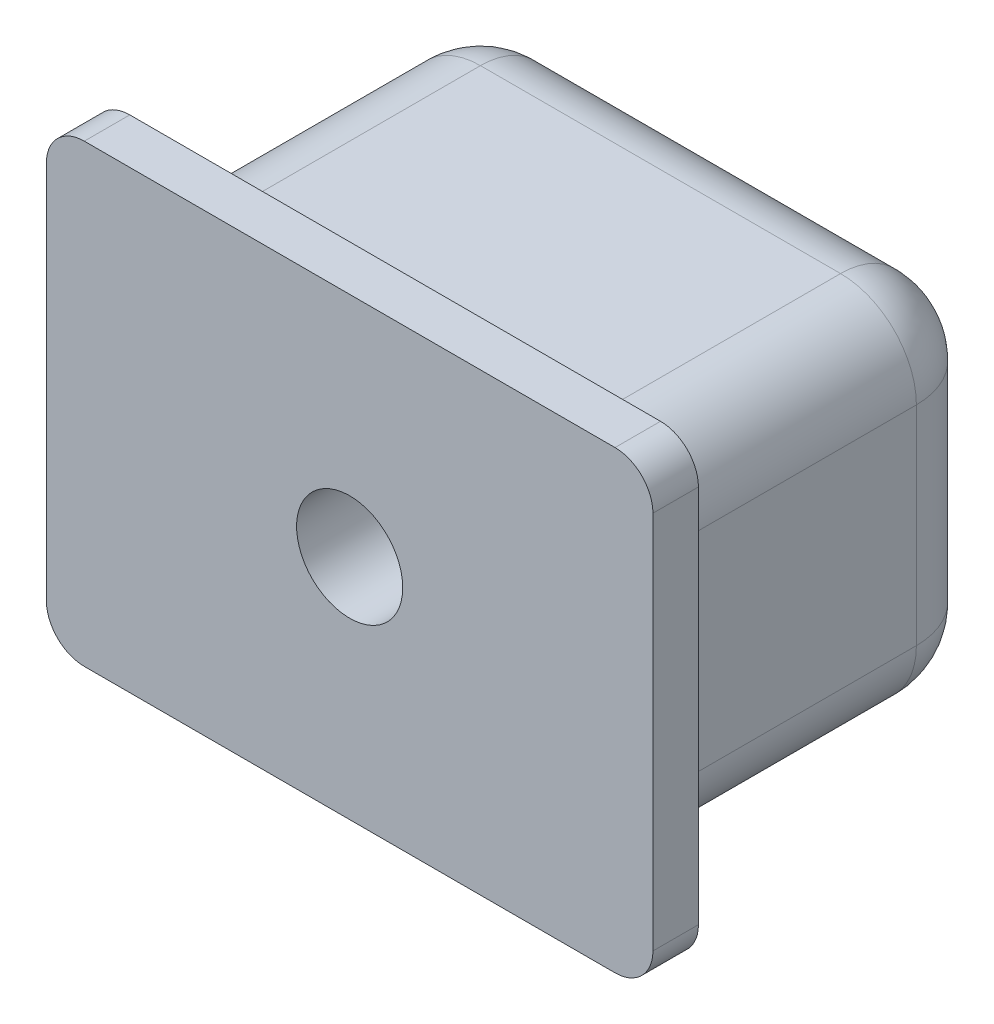
ISO-10303-21;
HEADER;
FILE_DESCRIPTION(('STEP AP214'),'2;1');
FILE_NAME('part.step','',(''),(''),'','','');
FILE_SCHEMA(('AUTOMOTIVE_DESIGN { 1 0 10303 214 1 1 1 1 }'));
ENDSEC;
DATA;
#1=APPLICATION_CONTEXT('core data for automotive mechanical design processes');
#2=APPLICATION_PROTOCOL_DEFINITION('international standard','automotive_design',2000,#1);
#3=PRODUCT_CONTEXT('',#1,'mechanical');
#4=PRODUCT('Part','Part','',(#3));
#5=PRODUCT_RELATED_PRODUCT_CATEGORY('part','',(#4));
#6=PRODUCT_DEFINITION_FORMATION('','',#4);
#7=PRODUCT_DEFINITION_CONTEXT('part definition',#1,'design');
#8=PRODUCT_DEFINITION('design','',#6,#7);
#9=PRODUCT_DEFINITION_SHAPE('','',#8);
#10=(LENGTH_UNIT() NAMED_UNIT(*) SI_UNIT(.MILLI.,.METRE.));
#11=(NAMED_UNIT(*) PLANE_ANGLE_UNIT() SI_UNIT($,.RADIAN.));
#12=(NAMED_UNIT(*) SI_UNIT($,.STERADIAN.) SOLID_ANGLE_UNIT());
#13=UNCERTAINTY_MEASURE_WITH_UNIT(LENGTH_MEASURE(1.E-05),#10,'distance_accuracy_value','');
#14=(GEOMETRIC_REPRESENTATION_CONTEXT(3) GLOBAL_UNCERTAINTY_ASSIGNED_CONTEXT((#13)) GLOBAL_UNIT_ASSIGNED_CONTEXT((#10,
#11,#12)) REPRESENTATION_CONTEXT('',''));
#15=CARTESIAN_POINT('',(0.,0.,0.));
#16=DIRECTION('',(0.,0.,1.));
#17=DIRECTION('',(1.,0.,0.));
#18=AXIS2_PLACEMENT_3D('',#15,#16,#17);
#19=CARTESIAN_POINT('',(6.75,-4.75,9.));
#20=DIRECTION('',(-1.,0.,0.));
#21=DIRECTION('',(0.,0.,1.));
#22=AXIS2_PLACEMENT_3D('',#19,#20,#21);
#23=PLANE('',#22);
#24=DIRECTION('',(0.,0.,-1.));
#25=VECTOR('',#24,1.);
#26=CARTESIAN_POINT('',(6.75,2.75,9.));
#27=LINE('',#26,#25);
#28=CARTESIAN_POINT('',(6.75,2.75,2.));
#29=VERTEX_POINT('',#28);
#30=CARTESIAN_POINT('',(6.75,2.75,8.6));
#31=VERTEX_POINT('',#30);
#32=EDGE_CURVE('E194',#29,#31,#27,.F.);
#33=ORIENTED_EDGE('',*,*,#32,.T.);
#34=DIRECTION('',(0.,1.,0.));
#35=VECTOR('',#34,1.);
#36=CARTESIAN_POINT('',(6.75,-4.75,8.6));
#37=LINE('',#36,#35);
#38=CARTESIAN_POINT('',(6.75,-2.75,8.6));
#39=VERTEX_POINT('',#38);
#40=EDGE_CURVE('E294',#31,#39,#37,.F.);
#41=ORIENTED_EDGE('',*,*,#40,.T.);
#42=DIRECTION('',(0.,0.,-1.));
#43=VECTOR('',#42,1.);
#44=CARTESIAN_POINT('',(6.75,-2.75,9.));
#45=LINE('',#44,#43);
#46=CARTESIAN_POINT('',(6.75,-2.75,2.));
#47=VERTEX_POINT('',#46);
#48=EDGE_CURVE('E196',#39,#47,#45,.T.);
#49=ORIENTED_EDGE('',*,*,#48,.T.);
#50=DIRECTION('',(0.,1.,0.));
#51=VECTOR('',#50,1.);
#52=CARTESIAN_POINT('',(6.75,2.75,2.));
#53=LINE('',#52,#51);
#54=EDGE_CURVE('E192',#47,#29,#53,.T.);
#55=ORIENTED_EDGE('',*,*,#54,.T.);
#56=EDGE_LOOP('',(#33,#41,#49,#55));
#57=FACE_BOUND('',#56,.T.);
#58=ADVANCED_FACE('F41',(#57),#23,.F.);
#59=CARTESIAN_POINT('',(-6.75,4.75,9.));
#60=DIRECTION('',(0.,-1.,0.));
#61=DIRECTION('',(0.,0.,-1.));
#62=AXIS2_PLACEMENT_3D('',#59,#60,#61);
#63=PLANE('',#62);
#64=DIRECTION('',(0.,0.,-1.));
#65=VECTOR('',#64,1.);
#66=CARTESIAN_POINT('',(-4.75,4.75,9.));
#67=LINE('',#66,#65);
#68=CARTESIAN_POINT('',(-4.75,4.75,2.));
#69=VERTEX_POINT('',#68);
#70=CARTESIAN_POINT('',(-4.75,4.75,8.6));
#71=VERTEX_POINT('',#70);
#72=EDGE_CURVE('E428',#69,#71,#67,.F.);
#73=ORIENTED_EDGE('',*,*,#72,.T.);
#74=DIRECTION('',(-1.,0.,0.));
#75=VECTOR('',#74,1.);
#76=CARTESIAN_POINT('',(-6.75,4.75,8.6));
#77=LINE('',#76,#75);
#78=CARTESIAN_POINT('',(4.75,4.75,8.6));
#79=VERTEX_POINT('',#78);
#80=EDGE_CURVE('E312',#71,#79,#77,.F.);
#81=ORIENTED_EDGE('',*,*,#80,.T.);
#82=DIRECTION('',(0.,0.,-1.));
#83=VECTOR('',#82,1.);
#84=CARTESIAN_POINT('',(4.75,4.75,9.));
#85=LINE('',#84,#83);
#86=CARTESIAN_POINT('',(4.75,4.75,2.));
#87=VERTEX_POINT('',#86);
#88=EDGE_CURVE('E224',#79,#87,#85,.T.);
#89=ORIENTED_EDGE('',*,*,#88,.T.);
#90=DIRECTION('',(-1.,0.,0.));
#91=VECTOR('',#90,1.);
#92=CARTESIAN_POINT('',(-4.75,4.75,2.));
#93=LINE('',#92,#91);
#94=EDGE_CURVE('E241',#87,#69,#93,.T.);
#95=ORIENTED_EDGE('',*,*,#94,.T.);
#96=EDGE_LOOP('',(#73,#81,#89,#95));
#97=FACE_BOUND('',#96,.T.);
#98=ADVANCED_FACE('F466',(#97),#63,.F.);
#99=CARTESIAN_POINT('',(-6.75,-4.75,9.));
#100=DIRECTION('',(1.,0.,0.));
#101=DIRECTION('',(0.,0.,-1.));
#102=AXIS2_PLACEMENT_3D('',#99,#100,#101);
#103=PLANE('',#102);
#104=DIRECTION('',(0.,0.,-1.));
#105=VECTOR('',#104,1.);
#106=CARTESIAN_POINT('',(-6.75,-2.75,9.));
#107=LINE('',#106,#105);
#108=CARTESIAN_POINT('',(-6.75,-2.75,2.));
#109=VERTEX_POINT('',#108);
#110=CARTESIAN_POINT('',(-6.75,-2.75,8.6));
#111=VERTEX_POINT('',#110);
#112=EDGE_CURVE('E213',#109,#111,#107,.F.);
#113=ORIENTED_EDGE('',*,*,#112,.T.);
#114=DIRECTION('',(0.,-1.,0.));
#115=VECTOR('',#114,1.);
#116=CARTESIAN_POINT('',(-6.75,-4.75,8.6));
#117=LINE('',#116,#115);
#118=CARTESIAN_POINT('',(-6.75,2.75,8.6));
#119=VERTEX_POINT('',#118);
#120=EDGE_CURVE('E306',#111,#119,#117,.F.);
#121=ORIENTED_EDGE('',*,*,#120,.T.);
#122=DIRECTION('',(0.,0.,-1.));
#123=VECTOR('',#122,1.);
#124=CARTESIAN_POINT('',(-6.75,2.75,9.));
#125=LINE('',#124,#123);
#126=CARTESIAN_POINT('',(-6.75,2.75,2.));
#127=VERTEX_POINT('',#126);
#128=EDGE_CURVE('E420',#119,#127,#125,.T.);
#129=ORIENTED_EDGE('',*,*,#128,.T.);
#130=DIRECTION('',(0.,-1.,0.));
#131=VECTOR('',#130,1.);
#132=CARTESIAN_POINT('',(-6.75,-2.75,2.));
#133=LINE('',#132,#131);
#134=EDGE_CURVE('E454',#127,#109,#133,.T.);
#135=ORIENTED_EDGE('',*,*,#134,.T.);
#136=EDGE_LOOP('',(#113,#121,#129,#135));
#137=FACE_BOUND('',#136,.T.);
#138=ADVANCED_FACE('F486',(#137),#103,.F.);
#139=CARTESIAN_POINT('',(-6.75,-4.75,9.));
#140=DIRECTION('',(0.,1.,0.));
#141=DIRECTION('',(0.,0.,1.));
#142=AXIS2_PLACEMENT_3D('',#139,#140,#141);
#143=PLANE('',#142);
#144=DIRECTION('',(0.,0.,-1.));
#145=VECTOR('',#144,1.);
#146=CARTESIAN_POINT('',(4.75,-4.75,9.));
#147=LINE('',#146,#145);
#148=CARTESIAN_POINT('',(4.75,-4.75,2.));
#149=VERTEX_POINT('',#148);
#150=CARTESIAN_POINT('',(4.75,-4.75,8.6));
#151=VERTEX_POINT('',#150);
#152=EDGE_CURVE('E412',#149,#151,#147,.F.);
#153=ORIENTED_EDGE('',*,*,#152,.T.);
#154=DIRECTION('',(1.,0.,0.));
#155=VECTOR('',#154,1.);
#156=CARTESIAN_POINT('',(-6.75,-4.75,8.6));
#157=LINE('',#156,#155);
#158=CARTESIAN_POINT('',(-4.75,-4.75,8.6));
#159=VERTEX_POINT('',#158);
#160=EDGE_CURVE('E300',#151,#159,#157,.F.);
#161=ORIENTED_EDGE('',*,*,#160,.T.);
#162=DIRECTION('',(0.,0.,-1.));
#163=VECTOR('',#162,1.);
#164=CARTESIAN_POINT('',(-4.75,-4.75,9.));
#165=LINE('',#164,#163);
#166=CARTESIAN_POINT('',(-4.75,-4.75,2.));
#167=VERTEX_POINT('',#166);
#168=EDGE_CURVE('E416',#159,#167,#165,.T.);
#169=ORIENTED_EDGE('',*,*,#168,.T.);
#170=DIRECTION('',(1.,0.,0.));
#171=VECTOR('',#170,1.);
#172=CARTESIAN_POINT('',(4.75,-4.75,2.));
#173=LINE('',#172,#171);
#174=EDGE_CURVE('E447',#167,#149,#173,.T.);
#175=ORIENTED_EDGE('',*,*,#174,.T.);
#176=EDGE_LOOP('',(#153,#161,#169,#175));
#177=FACE_BOUND('',#176,.T.);
#178=ADVANCED_FACE('F503',(#177),#143,.F.);
#179=CARTESIAN_POINT('',(0.,0.,0.));
#180=DIRECTION('',(0.,0.,-1.));
#181=DIRECTION('',(-1.,0.,0.));
#182=AXIS2_PLACEMENT_3D('',#179,#180,#181);
#183=PLANE('',#182);
#184=DIRECTION('',(-1.,0.,0.));
#185=VECTOR('',#184,1.);
#186=CARTESIAN_POINT('',(4.75,2.75,0.));
#187=LINE('',#186,#185);
#188=CARTESIAN_POINT('',(-4.75,2.75,0.));
#189=VERTEX_POINT('',#188);
#190=CARTESIAN_POINT('',(4.75,2.75,0.));
#191=VERTEX_POINT('',#190);
#192=EDGE_CURVE('E201',#189,#191,#187,.F.);
#193=ORIENTED_EDGE('',*,*,#192,.T.);
#194=DIRECTION('',(0.,1.,0.));
#195=VECTOR('',#194,1.);
#196=CARTESIAN_POINT('',(4.75,-2.75,0.));
#197=LINE('',#196,#195);
#198=CARTESIAN_POINT('',(4.75,-2.75,0.));
#199=VERTEX_POINT('',#198);
#200=EDGE_CURVE('E229',#191,#199,#197,.F.);
#201=ORIENTED_EDGE('',*,*,#200,.T.);
#202=DIRECTION('',(1.,0.,0.));
#203=VECTOR('',#202,1.);
#204=CARTESIAN_POINT('',(-4.75,-2.75,0.));
#205=LINE('',#204,#203);
#206=CARTESIAN_POINT('',(-4.75,-2.75,0.));
#207=VERTEX_POINT('',#206);
#208=EDGE_CURVE('E439',#199,#207,#205,.F.);
#209=ORIENTED_EDGE('',*,*,#208,.T.);
#210=DIRECTION('',(0.,-1.,0.));
#211=VECTOR('',#210,1.);
#212=CARTESIAN_POINT('',(-4.75,2.75,0.));
#213=LINE('',#212,#211);
#214=EDGE_CURVE('E436',#207,#189,#213,.F.);
#215=ORIENTED_EDGE('',*,*,#214,.T.);
#216=EDGE_LOOP('',(#193,#201,#209,#215));
#217=FACE_BOUND('',#216,.T.);
#218=ADVANCED_FACE('F478',(#217),#183,.T.);
#219=CARTESIAN_POINT('',(8.,-6.,10.2));
#220=DIRECTION('',(-1.,0.,0.));
#221=DIRECTION('',(0.,0.,1.));
#222=AXIS2_PLACEMENT_3D('',#219,#220,#221);
#223=PLANE('',#222);
#224=DIRECTION('',(0.,1.,0.));
#225=VECTOR('',#224,1.);
#226=CARTESIAN_POINT('',(8.,-6.,9.));
#227=LINE('',#226,#225);
#228=CARTESIAN_POINT('',(8.,-5.,9.));
#229=VERTEX_POINT('',#228);
#230=CARTESIAN_POINT('',(8.,5.,9.));
#231=VERTEX_POINT('',#230);
#232=EDGE_CURVE('E408',#229,#231,#227,.T.);
#233=ORIENTED_EDGE('',*,*,#232,.T.);
#234=DIRECTION('',(0.,0.,-1.));
#235=VECTOR('',#234,1.);
#236=CARTESIAN_POINT('',(8.,5.,10.2));
#237=LINE('',#236,#235);
#238=CARTESIAN_POINT('',(8.,5.,10.2));
#239=VERTEX_POINT('',#238);
#240=EDGE_CURVE('E363',#231,#239,#237,.F.);
#241=ORIENTED_EDGE('',*,*,#240,.T.);
#242=DIRECTION('',(0.,1.,0.));
#243=VECTOR('',#242,1.);
#244=CARTESIAN_POINT('',(8.,-6.,10.2));
#245=LINE('',#244,#243);
#246=CARTESIAN_POINT('',(8.,-5.,10.2));
#247=VERTEX_POINT('',#246);
#248=EDGE_CURVE('E406',#247,#239,#245,.T.);
#249=ORIENTED_EDGE('',*,*,#248,.F.);
#250=DIRECTION('',(0.,0.,-1.));
#251=VECTOR('',#250,1.);
#252=CARTESIAN_POINT('',(8.,-5.,10.2));
#253=LINE('',#252,#251);
#254=EDGE_CURVE('E359',#247,#229,#253,.T.);
#255=ORIENTED_EDGE('',*,*,#254,.T.);
#256=EDGE_LOOP('',(#233,#241,#249,#255));
#257=FACE_BOUND('',#256,.T.);
#258=ADVANCED_FACE('F671',(#257),#223,.F.);
#259=CARTESIAN_POINT('',(-8.,6.,10.2));
#260=DIRECTION('',(0.,-1.,0.));
#261=DIRECTION('',(0.,0.,-1.));
#262=AXIS2_PLACEMENT_3D('',#259,#260,#261);
#263=PLANE('',#262);
#264=DIRECTION('',(-1.,0.,0.));
#265=VECTOR('',#264,1.);
#266=CARTESIAN_POINT('',(-8.,6.,10.2));
#267=LINE('',#266,#265);
#268=CARTESIAN_POINT('',(7.,6.,10.2));
#269=VERTEX_POINT('',#268);
#270=CARTESIAN_POINT('',(-7.,6.,10.2));
#271=VERTEX_POINT('',#270);
#272=EDGE_CURVE('E764',#269,#271,#267,.T.);
#273=ORIENTED_EDGE('',*,*,#272,.F.);
#274=DIRECTION('',(0.,0.,-1.));
#275=VECTOR('',#274,1.);
#276=CARTESIAN_POINT('',(7.,6.,10.2));
#277=LINE('',#276,#275);
#278=CARTESIAN_POINT('',(7.,6.,9.));
#279=VERTEX_POINT('',#278);
#280=EDGE_CURVE('E343',#269,#279,#277,.T.);
#281=ORIENTED_EDGE('',*,*,#280,.T.);
#282=DIRECTION('',(-1.,0.,0.));
#283=VECTOR('',#282,1.);
#284=CARTESIAN_POINT('',(-8.,6.,9.));
#285=LINE('',#284,#283);
#286=CARTESIAN_POINT('',(-7.,6.,9.));
#287=VERTEX_POINT('',#286);
#288=EDGE_CURVE('E402',#279,#287,#285,.T.);
#289=ORIENTED_EDGE('',*,*,#288,.T.);
#290=DIRECTION('',(0.,0.,-1.));
#291=VECTOR('',#290,1.);
#292=CARTESIAN_POINT('',(-7.,6.,10.2));
#293=LINE('',#292,#291);
#294=EDGE_CURVE('E315',#287,#271,#293,.F.);
#295=ORIENTED_EDGE('',*,*,#294,.T.);
#296=EDGE_LOOP('',(#273,#281,#289,#295));
#297=FACE_BOUND('',#296,.T.);
#298=ADVANCED_FACE('F676',(#297),#263,.F.);
#299=CARTESIAN_POINT('',(-8.,-6.,10.2));
#300=DIRECTION('',(1.,0.,0.));
#301=DIRECTION('',(0.,0.,-1.));
#302=AXIS2_PLACEMENT_3D('',#299,#300,#301);
#303=PLANE('',#302);
#304=DIRECTION('',(0.,-1.,0.));
#305=VECTOR('',#304,1.);
#306=CARTESIAN_POINT('',(-8.,-6.,9.));
#307=LINE('',#306,#305);
#308=CARTESIAN_POINT('',(-8.,5.,9.));
#309=VERTEX_POINT('',#308);
#310=CARTESIAN_POINT('',(-8.,-5.,9.));
#311=VERTEX_POINT('',#310);
#312=EDGE_CURVE('E390',#309,#311,#307,.T.);
#313=ORIENTED_EDGE('',*,*,#312,.T.);
#314=DIRECTION('',(0.,0.,-1.));
#315=VECTOR('',#314,1.);
#316=CARTESIAN_POINT('',(-8.,-5.,10.2));
#317=LINE('',#316,#315);
#318=CARTESIAN_POINT('',(-8.,-5.,10.2));
#319=VERTEX_POINT('',#318);
#320=EDGE_CURVE('E11',#311,#319,#317,.F.);
#321=ORIENTED_EDGE('',*,*,#320,.T.);
#322=DIRECTION('',(0.,-1.,0.));
#323=VECTOR('',#322,1.);
#324=CARTESIAN_POINT('',(-8.,-6.,10.2));
#325=LINE('',#324,#323);
#326=CARTESIAN_POINT('',(-8.,5.,10.2));
#327=VERTEX_POINT('',#326);
#328=EDGE_CURVE('E392',#327,#319,#325,.T.);
#329=ORIENTED_EDGE('',*,*,#328,.F.);
#330=DIRECTION('',(0.,0.,-1.));
#331=VECTOR('',#330,1.);
#332=CARTESIAN_POINT('',(-8.,5.,10.2));
#333=LINE('',#332,#331);
#334=EDGE_CURVE('E50',#327,#309,#333,.T.);
#335=ORIENTED_EDGE('',*,*,#334,.T.);
#336=EDGE_LOOP('',(#313,#321,#329,#335));
#337=FACE_BOUND('',#336,.T.);
#338=ADVANCED_FACE('F389',(#337),#303,.F.);
#339=CARTESIAN_POINT('',(-8.,-6.,10.2));
#340=DIRECTION('',(0.,1.,0.));
#341=DIRECTION('',(0.,0.,1.));
#342=AXIS2_PLACEMENT_3D('',#339,#340,#341);
#343=PLANE('',#342);
#344=DIRECTION('',(1.,0.,0.));
#345=VECTOR('',#344,1.);
#346=CARTESIAN_POINT('',(-8.,-6.,9.));
#347=LINE('',#346,#345);
#348=CARTESIAN_POINT('',(-7.,-6.,9.));
#349=VERTEX_POINT('',#348);
#350=CARTESIAN_POINT('',(7.,-6.,9.));
#351=VERTEX_POINT('',#350);
#352=EDGE_CURVE('E401',#349,#351,#347,.T.);
#353=ORIENTED_EDGE('',*,*,#352,.T.);
#354=DIRECTION('',(0.,0.,-1.));
#355=VECTOR('',#354,1.);
#356=CARTESIAN_POINT('',(7.,-6.,10.2));
#357=LINE('',#356,#355);
#358=CARTESIAN_POINT('',(7.,-6.,10.2));
#359=VERTEX_POINT('',#358);
#360=EDGE_CURVE('E57',#351,#359,#357,.F.);
#361=ORIENTED_EDGE('',*,*,#360,.T.);
#362=DIRECTION('',(1.,0.,0.));
#363=VECTOR('',#362,1.);
#364=CARTESIAN_POINT('',(-8.,-6.,10.2));
#365=LINE('',#364,#363);
#366=CARTESIAN_POINT('',(-7.,-6.,10.2));
#367=VERTEX_POINT('',#366);
#368=EDGE_CURVE('E417',#367,#359,#365,.T.);
#369=ORIENTED_EDGE('',*,*,#368,.F.);
#370=DIRECTION('',(0.,0.,-1.));
#371=VECTOR('',#370,1.);
#372=CARTESIAN_POINT('',(-7.,-6.,10.2));
#373=LINE('',#372,#371);
#374=EDGE_CURVE('E377',#367,#349,#373,.T.);
#375=ORIENTED_EDGE('',*,*,#374,.T.);
#376=EDGE_LOOP('',(#353,#361,#369,#375));
#377=FACE_BOUND('',#376,.T.);
#378=ADVANCED_FACE('F697',(#377),#343,.F.);
#379=CARTESIAN_POINT('',(0.,0.,10.2));
#380=DIRECTION('',(0.,0.,-1.));
#381=DIRECTION('',(-1.,0.,0.));
#382=AXIS2_PLACEMENT_3D('',#379,#380,#381);
#383=PLANE('',#382);
#384=CARTESIAN_POINT('',(0.,0.,10.2));
#385=DIRECTION('',(0.,0.,1.));
#386=DIRECTION('',(1.,0.,0.));
#387=AXIS2_PLACEMENT_3D('',#384,#385,#386);
#388=CIRCLE('',#387,1.4);
#389=CARTESIAN_POINT('',(1.4,0.,10.2));
#390=VERTEX_POINT('',#389);
#391=EDGE_CURVE('E266',#390,#390,#388,.T.);
#392=ORIENTED_EDGE('',*,*,#391,.F.);
#393=EDGE_LOOP('',(#392));
#394=FACE_BOUND('',#393,.T.);
#395=ORIENTED_EDGE('',*,*,#248,.T.);
#396=CARTESIAN_POINT('',(7.,5.,10.2));
#397=DIRECTION('',(0.,0.,-1.));
#398=DIRECTION('',(-1.,0.,0.));
#399=AXIS2_PLACEMENT_3D('',#396,#397,#398);
#400=CIRCLE('',#399,1.);
#401=EDGE_CURVE('E374',#239,#269,#400,.F.);
#402=ORIENTED_EDGE('',*,*,#401,.T.);
#403=ORIENTED_EDGE('',*,*,#272,.T.);
#404=CARTESIAN_POINT('',(-7.,5.,10.2));
#405=DIRECTION('',(0.,0.,-1.));
#406=DIRECTION('',(-1.,0.,0.));
#407=AXIS2_PLACEMENT_3D('',#404,#405,#406);
#408=CIRCLE('',#407,1.);
#409=EDGE_CURVE('E366',#271,#327,#408,.F.);
#410=ORIENTED_EDGE('',*,*,#409,.T.);
#411=ORIENTED_EDGE('',*,*,#328,.T.);
#412=CARTESIAN_POINT('',(-7.,-5.,10.2));
#413=DIRECTION('',(0.,0.,-1.));
#414=DIRECTION('',(-1.,0.,0.));
#415=AXIS2_PLACEMENT_3D('',#412,#413,#414);
#416=CIRCLE('',#415,1.);
#417=EDGE_CURVE('E64',#319,#367,#416,.F.);
#418=ORIENTED_EDGE('',*,*,#417,.T.);
#419=ORIENTED_EDGE('',*,*,#368,.T.);
#420=CARTESIAN_POINT('',(7.,-5.,10.2));
#421=DIRECTION('',(0.,0.,-1.));
#422=DIRECTION('',(-1.,0.,0.));
#423=AXIS2_PLACEMENT_3D('',#420,#421,#422);
#424=CIRCLE('',#423,1.);
#425=EDGE_CURVE('E371',#359,#247,#424,.F.);
#426=ORIENTED_EDGE('',*,*,#425,.T.);
#427=EDGE_LOOP('',(#395,#402,#403,#410,#411,#418,#419,#426));
#428=FACE_BOUND('',#427,.T.);
#429=ADVANCED_FACE('F706',(#394,#428),#383,.F.);
#430=CARTESIAN_POINT('',(0.,0.,9.));
#431=DIRECTION('',(0.,0.,-1.));
#432=DIRECTION('',(-1.,0.,0.));
#433=AXIS2_PLACEMENT_3D('',#430,#431,#432);
#434=PLANE('',#433);
#435=DIRECTION('',(0.,1.,0.));
#436=VECTOR('',#435,1.);
#437=CARTESIAN_POINT('',(7.15,0.,9.));
#438=LINE('',#437,#436);
#439=CARTESIAN_POINT('',(7.15,-2.75,9.));
#440=VERTEX_POINT('',#439);
#441=CARTESIAN_POINT('',(7.15,2.75,9.));
#442=VERTEX_POINT('',#441);
#443=EDGE_CURVE('E285',#440,#442,#438,.T.);
#444=ORIENTED_EDGE('',*,*,#443,.T.);
#445=CARTESIAN_POINT('',(4.75,2.75,9.));
#446=DIRECTION('',(0.,0.,-1.));
#447=DIRECTION('',(-1.,0.,0.));
#448=AXIS2_PLACEMENT_3D('',#445,#446,#447);
#449=CIRCLE('',#448,2.4);
#450=CARTESIAN_POINT('',(4.75,5.15,9.));
#451=VERTEX_POINT('',#450);
#452=EDGE_CURVE('E288',#442,#451,#449,.F.);
#453=ORIENTED_EDGE('',*,*,#452,.T.);
#454=DIRECTION('',(-1.,0.,0.));
#455=VECTOR('',#454,1.);
#456=CARTESIAN_POINT('',(0.,5.15,9.));
#457=LINE('',#456,#455);
#458=CARTESIAN_POINT('',(-4.75,5.15,9.));
#459=VERTEX_POINT('',#458);
#460=EDGE_CURVE('E267',#451,#459,#457,.T.);
#461=ORIENTED_EDGE('',*,*,#460,.T.);
#462=CARTESIAN_POINT('',(-4.75,2.75,9.));
#463=DIRECTION('',(0.,0.,-1.));
#464=DIRECTION('',(-1.,0.,0.));
#465=AXIS2_PLACEMENT_3D('',#462,#463,#464);
#466=CIRCLE('',#465,2.4);
#467=CARTESIAN_POINT('',(-7.15,2.75,9.));
#468=VERTEX_POINT('',#467);
#469=EDGE_CURVE('E270',#459,#468,#466,.F.);
#470=ORIENTED_EDGE('',*,*,#469,.T.);
#471=DIRECTION('',(0.,-1.,0.));
#472=VECTOR('',#471,1.);
#473=CARTESIAN_POINT('',(-7.15,0.,9.));
#474=LINE('',#473,#472);
#475=CARTESIAN_POINT('',(-7.15,-2.75,9.));
#476=VERTEX_POINT('',#475);
#477=EDGE_CURVE('E273',#468,#476,#474,.T.);
#478=ORIENTED_EDGE('',*,*,#477,.T.);
#479=CARTESIAN_POINT('',(-4.75,-2.75,9.));
#480=DIRECTION('',(0.,0.,-1.));
#481=DIRECTION('',(-1.,0.,0.));
#482=AXIS2_PLACEMENT_3D('',#479,#480,#481);
#483=CIRCLE('',#482,2.4);
#484=CARTESIAN_POINT('',(-4.75,-5.15,9.));
#485=VERTEX_POINT('',#484);
#486=EDGE_CURVE('E276',#476,#485,#483,.F.);
#487=ORIENTED_EDGE('',*,*,#486,.T.);
#488=DIRECTION('',(1.,0.,0.));
#489=VECTOR('',#488,1.);
#490=CARTESIAN_POINT('',(0.,-5.15,9.));
#491=LINE('',#490,#489);
#492=CARTESIAN_POINT('',(4.75,-5.15,9.));
#493=VERTEX_POINT('',#492);
#494=EDGE_CURVE('E279',#485,#493,#491,.T.);
#495=ORIENTED_EDGE('',*,*,#494,.T.);
#496=CARTESIAN_POINT('',(4.75,-2.75,9.));
#497=DIRECTION('',(0.,0.,-1.));
#498=DIRECTION('',(-1.,0.,0.));
#499=AXIS2_PLACEMENT_3D('',#496,#497,#498);
#500=CIRCLE('',#499,2.4);
#501=EDGE_CURVE('E282',#493,#440,#500,.F.);
#502=ORIENTED_EDGE('',*,*,#501,.T.);
#503=EDGE_LOOP('',(#444,#453,#461,#470,#478,#487,#495,#502));
#504=FACE_BOUND('',#503,.T.);
#505=ORIENTED_EDGE('',*,*,#288,.F.);
#506=CARTESIAN_POINT('',(7.,5.,9.));
#507=DIRECTION('',(0.,0.,-1.));
#508=DIRECTION('',(-1.,0.,0.));
#509=AXIS2_PLACEMENT_3D('',#506,#507,#508);
#510=CIRCLE('',#509,1.);
#511=EDGE_CURVE('E356',#279,#231,#510,.T.);
#512=ORIENTED_EDGE('',*,*,#511,.T.);
#513=ORIENTED_EDGE('',*,*,#232,.F.);
#514=CARTESIAN_POINT('',(7.,-5.,9.));
#515=DIRECTION('',(0.,0.,-1.));
#516=DIRECTION('',(-1.,0.,0.));
#517=AXIS2_PLACEMENT_3D('',#514,#515,#516);
#518=CIRCLE('',#517,1.);
#519=EDGE_CURVE('E353',#229,#351,#518,.T.);
#520=ORIENTED_EDGE('',*,*,#519,.T.);
#521=ORIENTED_EDGE('',*,*,#352,.F.);
#522=CARTESIAN_POINT('',(-7.,-5.,9.));
#523=DIRECTION('',(0.,0.,-1.));
#524=DIRECTION('',(-1.,0.,0.));
#525=AXIS2_PLACEMENT_3D('',#522,#523,#524);
#526=CIRCLE('',#525,1.);
#527=EDGE_CURVE('E350',#349,#311,#526,.T.);
#528=ORIENTED_EDGE('',*,*,#527,.T.);
#529=ORIENTED_EDGE('',*,*,#312,.F.);
#530=CARTESIAN_POINT('',(-7.,5.,9.));
#531=DIRECTION('',(0.,0.,-1.));
#532=DIRECTION('',(-1.,0.,0.));
#533=AXIS2_PLACEMENT_3D('',#530,#531,#532);
#534=CIRCLE('',#533,1.);
#535=EDGE_CURVE('E347',#309,#287,#534,.T.);
#536=ORIENTED_EDGE('',*,*,#535,.T.);
#537=EDGE_LOOP('',(#505,#512,#513,#520,#521,#528,#529,#536));
#538=FACE_BOUND('',#537,.T.);
#539=ADVANCED_FACE('F397',(#504,#538),#434,.T.);
#540=CARTESIAN_POINT('',(0.,0.,5.2));
#541=DIRECTION('',(0.,0.,1.));
#542=DIRECTION('',(1.,0.,0.));
#543=AXIS2_PLACEMENT_3D('',#540,#541,#542);
#544=CYLINDRICAL_SURFACE('',#543,1.4);
#545=CARTESIAN_POINT('',(0.,0.,5.2));
#546=DIRECTION('',(0.,0.,1.));
#547=DIRECTION('',(1.,0.,0.));
#548=AXIS2_PLACEMENT_3D('',#545,#546,#547);
#549=CIRCLE('',#548,1.4);
#550=CARTESIAN_POINT('',(1.4,0.,5.2));
#551=VERTEX_POINT('',#550);
#552=EDGE_CURVE('E778',#551,#551,#549,.T.);
#553=ORIENTED_EDGE('',*,*,#552,.F.);
#554=EDGE_LOOP('',(#553));
#555=FACE_BOUND('',#554,.T.);
#556=ORIENTED_EDGE('',*,*,#391,.T.);
#557=EDGE_LOOP('',(#556));
#558=FACE_BOUND('',#557,.T.);
#559=ADVANCED_FACE('F724',(#555,#558),#544,.F.);
#560=CARTESIAN_POINT('',(0.,0.,5.2));
#561=DIRECTION('',(0.,0.,1.));
#562=DIRECTION('',(1.,0.,0.));
#563=AXIS2_PLACEMENT_3D('',#560,#561,#562);
#564=PLANE('',#563);
#565=ORIENTED_EDGE('',*,*,#552,.T.);
#566=EDGE_LOOP('',(#565));
#567=FACE_BOUND('',#566,.T.);
#568=ADVANCED_FACE('F565',(#567),#564,.T.);
#569=CARTESIAN_POINT('',(-4.75,-2.75,9.));
#570=DIRECTION('',(0.,0.,-1.));
#571=DIRECTION('',(-1.,0.,0.));
#572=AXIS2_PLACEMENT_3D('',#569,#570,#571);
#573=CYLINDRICAL_SURFACE('',#572,2.);
#574=ORIENTED_EDGE('',*,*,#168,.F.);
#575=CARTESIAN_POINT('',(-4.75,-2.75,8.6));
#576=DIRECTION('',(0.,0.,-1.));
#577=DIRECTION('',(-1.,0.,0.));
#578=AXIS2_PLACEMENT_3D('',#575,#576,#577);
#579=CIRCLE('',#578,2.);
#580=EDGE_CURVE('E303',#159,#111,#579,.T.);
#581=ORIENTED_EDGE('',*,*,#580,.T.);
#582=ORIENTED_EDGE('',*,*,#112,.F.);
#583=CARTESIAN_POINT('',(-4.75,-2.75,2.));
#584=DIRECTION('',(0.,0.,-1.));
#585=DIRECTION('',(-1.,0.,0.));
#586=AXIS2_PLACEMENT_3D('',#583,#584,#585);
#587=CIRCLE('',#586,2.);
#588=EDGE_CURVE('E450',#109,#167,#587,.F.);
#589=ORIENTED_EDGE('',*,*,#588,.T.);
#590=EDGE_LOOP('',(#574,#581,#582,#589));
#591=FACE_BOUND('',#590,.T.);
#592=ADVANCED_FACE('F491',(#591),#573,.T.);
#593=CARTESIAN_POINT('',(4.75,-2.75,9.));
#594=DIRECTION('',(0.,0.,-1.));
#595=DIRECTION('',(-1.,0.,0.));
#596=AXIS2_PLACEMENT_3D('',#593,#594,#595);
#597=CYLINDRICAL_SURFACE('',#596,2.);
#598=ORIENTED_EDGE('',*,*,#48,.F.);
#599=CARTESIAN_POINT('',(4.75,-2.75,8.6));
#600=DIRECTION('',(0.,0.,-1.));
#601=DIRECTION('',(-1.,0.,0.));
#602=AXIS2_PLACEMENT_3D('',#599,#600,#601);
#603=CIRCLE('',#602,2.);
#604=EDGE_CURVE('E297',#39,#151,#603,.T.);
#605=ORIENTED_EDGE('',*,*,#604,.T.);
#606=ORIENTED_EDGE('',*,*,#152,.F.);
#607=CARTESIAN_POINT('',(4.75,-2.75,2.));
#608=DIRECTION('',(0.,0.,-1.));
#609=DIRECTION('',(-1.,0.,0.));
#610=AXIS2_PLACEMENT_3D('',#607,#608,#609);
#611=CIRCLE('',#610,2.);
#612=EDGE_CURVE('E444',#149,#47,#611,.F.);
#613=ORIENTED_EDGE('',*,*,#612,.T.);
#614=EDGE_LOOP('',(#598,#605,#606,#613));
#615=FACE_BOUND('',#614,.T.);
#616=ADVANCED_FACE('F506',(#615),#597,.T.);
#617=CARTESIAN_POINT('',(4.75,2.75,9.));
#618=DIRECTION('',(0.,0.,-1.));
#619=DIRECTION('',(-1.,0.,0.));
#620=AXIS2_PLACEMENT_3D('',#617,#618,#619);
#621=CYLINDRICAL_SURFACE('',#620,2.);
#622=ORIENTED_EDGE('',*,*,#88,.F.);
#623=CARTESIAN_POINT('',(4.75,2.75,8.6));
#624=DIRECTION('',(0.,0.,-1.));
#625=DIRECTION('',(-1.,0.,0.));
#626=AXIS2_PLACEMENT_3D('',#623,#624,#625);
#627=CIRCLE('',#626,2.);
#628=EDGE_CURVE('E211',#79,#31,#627,.T.);
#629=ORIENTED_EDGE('',*,*,#628,.T.);
#630=ORIENTED_EDGE('',*,*,#32,.F.);
#631=CARTESIAN_POINT('',(4.75,2.75,2.));
#632=DIRECTION('',(0.,0.,-1.));
#633=DIRECTION('',(-1.,0.,0.));
#634=AXIS2_PLACEMENT_3D('',#631,#632,#633);
#635=CIRCLE('',#634,2.);
#636=EDGE_CURVE('E202',#29,#87,#635,.F.);
#637=ORIENTED_EDGE('',*,*,#636,.T.);
#638=EDGE_LOOP('',(#622,#629,#630,#637));
#639=FACE_BOUND('',#638,.T.);
#640=ADVANCED_FACE('F209',(#639),#621,.T.);
#641=CARTESIAN_POINT('',(-4.75,2.75,9.));
#642=DIRECTION('',(0.,0.,-1.));
#643=DIRECTION('',(-1.,0.,0.));
#644=AXIS2_PLACEMENT_3D('',#641,#642,#643);
#645=CYLINDRICAL_SURFACE('',#644,2.);
#646=ORIENTED_EDGE('',*,*,#128,.F.);
#647=CARTESIAN_POINT('',(-4.75,2.75,8.6));
#648=DIRECTION('',(0.,0.,-1.));
#649=DIRECTION('',(-1.,0.,0.));
#650=AXIS2_PLACEMENT_3D('',#647,#648,#649);
#651=CIRCLE('',#650,2.);
#652=EDGE_CURVE('E309',#119,#71,#651,.T.);
#653=ORIENTED_EDGE('',*,*,#652,.T.);
#654=ORIENTED_EDGE('',*,*,#72,.F.);
#655=CARTESIAN_POINT('',(-4.75,2.75,2.));
#656=DIRECTION('',(0.,0.,-1.));
#657=DIRECTION('',(-1.,0.,0.));
#658=AXIS2_PLACEMENT_3D('',#655,#656,#657);
#659=CIRCLE('',#658,2.);
#660=EDGE_CURVE('E456',#69,#127,#659,.F.);
#661=ORIENTED_EDGE('',*,*,#660,.T.);
#662=EDGE_LOOP('',(#646,#653,#654,#661));
#663=FACE_BOUND('',#662,.T.);
#664=ADVANCED_FACE('F469',(#663),#645,.T.);
#665=CARTESIAN_POINT('',(-4.75,-2.75,2.));
#666=DIRECTION('',(0.,0.,-1.));
#667=DIRECTION('',(-1.,0.,0.));
#668=AXIS2_PLACEMENT_3D('',#665,#666,#667);
#669=SPHERICAL_SURFACE('',#668,2.);
#670=CARTESIAN_POINT('',(-4.75,-2.75,2.));
#671=DIRECTION('',(1.,0.,0.));
#672=DIRECTION('',(0.,0.,-1.));
#673=AXIS2_PLACEMENT_3D('',#670,#671,#672);
#674=CIRCLE('',#673,2.);
#675=EDGE_CURVE('E258',#167,#207,#674,.T.);
#676=ORIENTED_EDGE('',*,*,#675,.F.);
#677=ORIENTED_EDGE('',*,*,#588,.F.);
#678=CARTESIAN_POINT('',(-4.75,-2.75,2.));
#679=DIRECTION('',(0.,1.,0.));
#680=DIRECTION('',(0.,0.,1.));
#681=AXIS2_PLACEMENT_3D('',#678,#679,#680);
#682=CIRCLE('',#681,2.);
#683=EDGE_CURVE('E262',#207,#109,#682,.T.);
#684=ORIENTED_EDGE('',*,*,#683,.F.);
#685=EDGE_LOOP('',(#676,#677,#684));
#686=FACE_BOUND('',#685,.T.);
#687=ADVANCED_FACE('F495',(#686),#669,.T.);
#688=CARTESIAN_POINT('',(-4.75,-4.75,2.));
#689=DIRECTION('',(0.,1.,0.));
#690=DIRECTION('',(0.,0.,1.));
#691=AXIS2_PLACEMENT_3D('',#688,#689,#690);
#692=CYLINDRICAL_SURFACE('',#691,2.);
#693=ORIENTED_EDGE('',*,*,#683,.T.);
#694=ORIENTED_EDGE('',*,*,#134,.F.);
#695=CARTESIAN_POINT('',(-4.75,2.75,2.));
#696=DIRECTION('',(0.,1.,0.));
#697=DIRECTION('',(0.,0.,1.));
#698=AXIS2_PLACEMENT_3D('',#695,#696,#697);
#699=CIRCLE('',#698,2.);
#700=EDGE_CURVE('E254',#189,#127,#699,.T.);
#701=ORIENTED_EDGE('',*,*,#700,.F.);
#702=ORIENTED_EDGE('',*,*,#214,.F.);
#703=EDGE_LOOP('',(#693,#694,#701,#702));
#704=FACE_BOUND('',#703,.T.);
#705=ADVANCED_FACE('F482',(#704),#692,.T.);
#706=CARTESIAN_POINT('',(-6.75,-2.75,2.));
#707=DIRECTION('',(-1.,0.,0.));
#708=DIRECTION('',(0.,0.,1.));
#709=AXIS2_PLACEMENT_3D('',#706,#707,#708);
#710=CYLINDRICAL_SURFACE('',#709,2.);
#711=ORIENTED_EDGE('',*,*,#675,.T.);
#712=ORIENTED_EDGE('',*,*,#208,.F.);
#713=CARTESIAN_POINT('',(4.75,-2.75,2.));
#714=DIRECTION('',(1.,0.,0.));
#715=DIRECTION('',(0.,0.,-1.));
#716=AXIS2_PLACEMENT_3D('',#713,#714,#715);
#717=CIRCLE('',#716,2.);
#718=EDGE_CURVE('E250',#149,#199,#717,.T.);
#719=ORIENTED_EDGE('',*,*,#718,.F.);
#720=ORIENTED_EDGE('',*,*,#174,.F.);
#721=EDGE_LOOP('',(#711,#712,#719,#720));
#722=FACE_BOUND('',#721,.T.);
#723=ADVANCED_FACE('F499',(#722),#710,.T.);
#724=CARTESIAN_POINT('',(-4.75,2.75,2.));
#725=DIRECTION('',(0.,0.,-1.));
#726=DIRECTION('',(-1.,0.,0.));
#727=AXIS2_PLACEMENT_3D('',#724,#725,#726);
#728=SPHERICAL_SURFACE('',#727,2.);
#729=ORIENTED_EDGE('',*,*,#700,.T.);
#730=ORIENTED_EDGE('',*,*,#660,.F.);
#731=CARTESIAN_POINT('',(-4.75,2.75,2.));
#732=DIRECTION('',(1.,0.,0.));
#733=DIRECTION('',(0.,0.,-1.));
#734=AXIS2_PLACEMENT_3D('',#731,#732,#733);
#735=CIRCLE('',#734,2.);
#736=EDGE_CURVE('E246',#189,#69,#735,.T.);
#737=ORIENTED_EDGE('',*,*,#736,.F.);
#738=EDGE_LOOP('',(#729,#730,#737));
#739=FACE_BOUND('',#738,.T.);
#740=ADVANCED_FACE('F473',(#739),#728,.T.);
#741=CARTESIAN_POINT('',(4.75,-2.75,2.));
#742=DIRECTION('',(0.,0.,-1.));
#743=DIRECTION('',(-1.,0.,0.));
#744=AXIS2_PLACEMENT_3D('',#741,#742,#743);
#745=SPHERICAL_SURFACE('',#744,2.);
#746=ORIENTED_EDGE('',*,*,#612,.F.);
#747=ORIENTED_EDGE('',*,*,#718,.T.);
#748=CARTESIAN_POINT('',(4.75,-2.75,2.));
#749=DIRECTION('',(0.,1.,0.));
#750=DIRECTION('',(0.,0.,1.));
#751=AXIS2_PLACEMENT_3D('',#748,#749,#750);
#752=CIRCLE('',#751,2.);
#753=EDGE_CURVE('E235',#47,#199,#752,.T.);
#754=ORIENTED_EDGE('',*,*,#753,.F.);
#755=EDGE_LOOP('',(#746,#747,#754));
#756=FACE_BOUND('',#755,.T.);
#757=ADVANCED_FACE('F578',(#756),#745,.T.);
#758=CARTESIAN_POINT('',(-6.75,2.75,2.));
#759=DIRECTION('',(1.,0.,0.));
#760=DIRECTION('',(0.,0.,-1.));
#761=AXIS2_PLACEMENT_3D('',#758,#759,#760);
#762=CYLINDRICAL_SURFACE('',#761,2.);
#763=ORIENTED_EDGE('',*,*,#736,.T.);
#764=ORIENTED_EDGE('',*,*,#94,.F.);
#765=CARTESIAN_POINT('',(4.75,2.75,2.));
#766=DIRECTION('',(1.,0.,0.));
#767=DIRECTION('',(0.,0.,-1.));
#768=AXIS2_PLACEMENT_3D('',#765,#766,#767);
#769=CIRCLE('',#768,2.);
#770=EDGE_CURVE('E221',#191,#87,#769,.T.);
#771=ORIENTED_EDGE('',*,*,#770,.F.);
#772=ORIENTED_EDGE('',*,*,#192,.F.);
#773=EDGE_LOOP('',(#763,#764,#771,#772));
#774=FACE_BOUND('',#773,.T.);
#775=ADVANCED_FACE('F476',(#774),#762,.T.);
#776=CARTESIAN_POINT('',(4.75,-4.75,2.));
#777=DIRECTION('',(0.,-1.,0.));
#778=DIRECTION('',(0.,0.,-1.));
#779=AXIS2_PLACEMENT_3D('',#776,#777,#778);
#780=CYLINDRICAL_SURFACE('',#779,2.);
#781=ORIENTED_EDGE('',*,*,#753,.T.);
#782=ORIENTED_EDGE('',*,*,#200,.F.);
#783=CARTESIAN_POINT('',(4.75,2.75,2.));
#784=DIRECTION('',(0.,1.,0.));
#785=DIRECTION('',(0.,0.,1.));
#786=AXIS2_PLACEMENT_3D('',#783,#784,#785);
#787=CIRCLE('',#786,2.);
#788=EDGE_CURVE('E219',#29,#191,#787,.T.);
#789=ORIENTED_EDGE('',*,*,#788,.F.);
#790=ORIENTED_EDGE('',*,*,#54,.F.);
#791=EDGE_LOOP('',(#781,#782,#789,#790));
#792=FACE_BOUND('',#791,.T.);
#793=ADVANCED_FACE('F227',(#792),#780,.T.);
#794=CARTESIAN_POINT('',(4.75,2.75,2.));
#795=DIRECTION('',(0.,0.,-1.));
#796=DIRECTION('',(-1.,0.,0.));
#797=AXIS2_PLACEMENT_3D('',#794,#795,#796);
#798=SPHERICAL_SURFACE('',#797,2.);
#799=ORIENTED_EDGE('',*,*,#770,.T.);
#800=ORIENTED_EDGE('',*,*,#636,.F.);
#801=ORIENTED_EDGE('',*,*,#788,.T.);
#802=EDGE_LOOP('',(#799,#800,#801));
#803=FACE_BOUND('',#802,.T.);
#804=ADVANCED_FACE('F218',(#803),#798,.T.);
#805=CARTESIAN_POINT('',(-4.75,-2.75,8.6));
#806=DIRECTION('',(0.,0.,-1.));
#807=DIRECTION('',(-1.,0.,0.));
#808=AXIS2_PLACEMENT_3D('',#805,#806,#807);
#809=TOROIDAL_SURFACE('',#808,2.4,0.4);
#810=CARTESIAN_POINT('',(-7.15,-2.75,8.6));
#811=DIRECTION('',(0.,-1.,0.));
#812=DIRECTION('',(0.,0.,-1.));
#813=AXIS2_PLACEMENT_3D('',#810,#811,#812);
#814=CIRCLE('',#813,0.4);
#815=EDGE_CURVE('E238',#111,#476,#814,.T.);
#816=ORIENTED_EDGE('',*,*,#815,.F.);
#817=ORIENTED_EDGE('',*,*,#580,.F.);
#818=CARTESIAN_POINT('',(-4.75,-5.15,8.6));
#819=DIRECTION('',(-1.,0.,0.));
#820=DIRECTION('',(0.,0.,1.));
#821=AXIS2_PLACEMENT_3D('',#818,#819,#820);
#822=CIRCLE('',#821,0.4);
#823=EDGE_CURVE('E231',#485,#159,#822,.T.);
#824=ORIENTED_EDGE('',*,*,#823,.F.);
#825=ORIENTED_EDGE('',*,*,#486,.F.);
#826=EDGE_LOOP('',(#816,#817,#824,#825));
#827=FACE_BOUND('',#826,.T.);
#828=ADVANCED_FACE('F527',(#827),#809,.F.);
#829=CARTESIAN_POINT('',(0.,-5.15,8.6));
#830=DIRECTION('',(1.,0.,0.));
#831=DIRECTION('',(0.,0.,-1.));
#832=AXIS2_PLACEMENT_3D('',#829,#830,#831);
#833=CYLINDRICAL_SURFACE('',#832,0.4);
#834=ORIENTED_EDGE('',*,*,#823,.T.);
#835=ORIENTED_EDGE('',*,*,#160,.F.);
#836=CARTESIAN_POINT('',(4.75,-5.15,8.6));
#837=DIRECTION('',(-1.,0.,0.));
#838=DIRECTION('',(0.,0.,1.));
#839=AXIS2_PLACEMENT_3D('',#836,#837,#838);
#840=CIRCLE('',#839,0.4);
#841=EDGE_CURVE('E334',#493,#151,#840,.T.);
#842=ORIENTED_EDGE('',*,*,#841,.F.);
#843=ORIENTED_EDGE('',*,*,#494,.F.);
#844=EDGE_LOOP('',(#834,#835,#842,#843));
#845=FACE_BOUND('',#844,.T.);
#846=ADVANCED_FACE('F525',(#845),#833,.F.);
#847=CARTESIAN_POINT('',(-7.15,0.,8.6));
#848=DIRECTION('',(0.,-1.,0.));
#849=DIRECTION('',(0.,0.,-1.));
#850=AXIS2_PLACEMENT_3D('',#847,#848,#849);
#851=CYLINDRICAL_SURFACE('',#850,0.4);
#852=ORIENTED_EDGE('',*,*,#815,.T.);
#853=ORIENTED_EDGE('',*,*,#477,.F.);
#854=CARTESIAN_POINT('',(-7.15,2.75,8.6));
#855=DIRECTION('',(0.,-1.,0.));
#856=DIRECTION('',(0.,0.,-1.));
#857=AXIS2_PLACEMENT_3D('',#854,#855,#856);
#858=CIRCLE('',#857,0.4);
#859=EDGE_CURVE('E330',#119,#468,#858,.T.);
#860=ORIENTED_EDGE('',*,*,#859,.F.);
#861=ORIENTED_EDGE('',*,*,#120,.F.);
#862=EDGE_LOOP('',(#852,#853,#860,#861));
#863=FACE_BOUND('',#862,.T.);
#864=ADVANCED_FACE('F532',(#863),#851,.F.);
#865=CARTESIAN_POINT('',(4.75,-2.75,8.6));
#866=DIRECTION('',(0.,0.,-1.));
#867=DIRECTION('',(-1.,0.,0.));
#868=AXIS2_PLACEMENT_3D('',#865,#866,#867);
#869=TOROIDAL_SURFACE('',#868,2.4,0.4);
#870=ORIENTED_EDGE('',*,*,#841,.T.);
#871=ORIENTED_EDGE('',*,*,#604,.F.);
#872=CARTESIAN_POINT('',(7.15,-2.75,8.6));
#873=DIRECTION('',(0.,-1.,0.));
#874=DIRECTION('',(0.,0.,-1.));
#875=AXIS2_PLACEMENT_3D('',#872,#873,#874);
#876=CIRCLE('',#875,0.4);
#877=EDGE_CURVE('E326',#440,#39,#876,.T.);
#878=ORIENTED_EDGE('',*,*,#877,.F.);
#879=ORIENTED_EDGE('',*,*,#501,.F.);
#880=EDGE_LOOP('',(#870,#871,#878,#879));
#881=FACE_BOUND('',#880,.T.);
#882=ADVANCED_FACE('F511',(#881),#869,.F.);
#883=CARTESIAN_POINT('',(-4.75,2.75,8.6));
#884=DIRECTION('',(0.,0.,-1.));
#885=DIRECTION('',(-1.,0.,0.));
#886=AXIS2_PLACEMENT_3D('',#883,#884,#885);
#887=TOROIDAL_SURFACE('',#886,2.4,0.4);
#888=ORIENTED_EDGE('',*,*,#859,.T.);
#889=ORIENTED_EDGE('',*,*,#469,.F.);
#890=CARTESIAN_POINT('',(-4.75,5.15,8.6));
#891=DIRECTION('',(-1.,0.,0.));
#892=DIRECTION('',(0.,0.,1.));
#893=AXIS2_PLACEMENT_3D('',#890,#891,#892);
#894=CIRCLE('',#893,0.4);
#895=EDGE_CURVE('E322',#71,#459,#894,.T.);
#896=ORIENTED_EDGE('',*,*,#895,.F.);
#897=ORIENTED_EDGE('',*,*,#652,.F.);
#898=EDGE_LOOP('',(#888,#889,#896,#897));
#899=FACE_BOUND('',#898,.T.);
#900=ADVANCED_FACE('F535',(#899),#887,.F.);
#901=CARTESIAN_POINT('',(7.15,0.,8.6));
#902=DIRECTION('',(0.,1.,0.));
#903=DIRECTION('',(0.,0.,1.));
#904=AXIS2_PLACEMENT_3D('',#901,#902,#903);
#905=CYLINDRICAL_SURFACE('',#904,0.4);
#906=ORIENTED_EDGE('',*,*,#877,.T.);
#907=ORIENTED_EDGE('',*,*,#40,.F.);
#908=CARTESIAN_POINT('',(7.15,2.75,8.6));
#909=DIRECTION('',(0.,-1.,0.));
#910=DIRECTION('',(0.,0.,-1.));
#911=AXIS2_PLACEMENT_3D('',#908,#909,#910);
#912=CIRCLE('',#911,0.4);
#913=EDGE_CURVE('E319',#442,#31,#912,.T.);
#914=ORIENTED_EDGE('',*,*,#913,.F.);
#915=ORIENTED_EDGE('',*,*,#443,.F.);
#916=EDGE_LOOP('',(#906,#907,#914,#915));
#917=FACE_BOUND('',#916,.T.);
#918=ADVANCED_FACE('F517',(#917),#905,.F.);
#919=CARTESIAN_POINT('',(0.,5.15,8.6));
#920=DIRECTION('',(-1.,0.,0.));
#921=DIRECTION('',(0.,0.,1.));
#922=AXIS2_PLACEMENT_3D('',#919,#920,#921);
#923=CYLINDRICAL_SURFACE('',#922,0.4);
#924=ORIENTED_EDGE('',*,*,#895,.T.);
#925=ORIENTED_EDGE('',*,*,#460,.F.);
#926=CARTESIAN_POINT('',(4.75,5.15,8.6));
#927=DIRECTION('',(-1.,0.,0.));
#928=DIRECTION('',(0.,0.,1.));
#929=AXIS2_PLACEMENT_3D('',#926,#927,#928);
#930=CIRCLE('',#929,0.4);
#931=EDGE_CURVE('E316',#79,#451,#930,.T.);
#932=ORIENTED_EDGE('',*,*,#931,.F.);
#933=ORIENTED_EDGE('',*,*,#80,.F.);
#934=EDGE_LOOP('',(#924,#925,#932,#933));
#935=FACE_BOUND('',#934,.T.);
#936=ADVANCED_FACE('F540',(#935),#923,.F.);
#937=CARTESIAN_POINT('',(4.75,2.75,8.6));
#938=DIRECTION('',(0.,0.,-1.));
#939=DIRECTION('',(-1.,0.,0.));
#940=AXIS2_PLACEMENT_3D('',#937,#938,#939);
#941=TOROIDAL_SURFACE('',#940,2.4,0.4);
#942=ORIENTED_EDGE('',*,*,#913,.T.);
#943=ORIENTED_EDGE('',*,*,#628,.F.);
#944=ORIENTED_EDGE('',*,*,#931,.T.);
#945=ORIENTED_EDGE('',*,*,#452,.F.);
#946=EDGE_LOOP('',(#942,#943,#944,#945));
#947=FACE_BOUND('',#946,.T.);
#948=ADVANCED_FACE('F542',(#947),#941,.F.);
#949=CARTESIAN_POINT('',(7.,5.,10.2));
#950=DIRECTION('',(0.,0.,-1.));
#951=DIRECTION('',(-1.,0.,0.));
#952=AXIS2_PLACEMENT_3D('',#949,#950,#951);
#953=CYLINDRICAL_SURFACE('',#952,1.);
#954=ORIENTED_EDGE('',*,*,#401,.F.);
#955=ORIENTED_EDGE('',*,*,#240,.F.);
#956=ORIENTED_EDGE('',*,*,#511,.F.);
#957=ORIENTED_EDGE('',*,*,#280,.F.);
#958=EDGE_LOOP('',(#954,#955,#956,#957));
#959=FACE_BOUND('',#958,.T.);
#960=ADVANCED_FACE('F544',(#959),#953,.T.);
#961=CARTESIAN_POINT('',(7.,-5.,10.2));
#962=DIRECTION('',(0.,0.,-1.));
#963=DIRECTION('',(-1.,0.,0.));
#964=AXIS2_PLACEMENT_3D('',#961,#962,#963);
#965=CYLINDRICAL_SURFACE('',#964,1.);
#966=ORIENTED_EDGE('',*,*,#425,.F.);
#967=ORIENTED_EDGE('',*,*,#360,.F.);
#968=ORIENTED_EDGE('',*,*,#519,.F.);
#969=ORIENTED_EDGE('',*,*,#254,.F.);
#970=EDGE_LOOP('',(#966,#967,#968,#969));
#971=FACE_BOUND('',#970,.T.);
#972=ADVANCED_FACE('F550',(#971),#965,.T.);
#973=CARTESIAN_POINT('',(-7.,-5.,10.2));
#974=DIRECTION('',(0.,0.,-1.));
#975=DIRECTION('',(-1.,0.,0.));
#976=AXIS2_PLACEMENT_3D('',#973,#974,#975);
#977=CYLINDRICAL_SURFACE('',#976,1.);
#978=ORIENTED_EDGE('',*,*,#417,.F.);
#979=ORIENTED_EDGE('',*,*,#320,.F.);
#980=ORIENTED_EDGE('',*,*,#527,.F.);
#981=ORIENTED_EDGE('',*,*,#374,.F.);
#982=EDGE_LOOP('',(#978,#979,#980,#981));
#983=FACE_BOUND('',#982,.T.);
#984=ADVANCED_FACE('F740',(#983),#977,.T.);
#985=CARTESIAN_POINT('',(-7.,5.,10.2));
#986=DIRECTION('',(0.,0.,-1.));
#987=DIRECTION('',(-1.,0.,0.));
#988=AXIS2_PLACEMENT_3D('',#985,#986,#987);
#989=CYLINDRICAL_SURFACE('',#988,1.);
#990=ORIENTED_EDGE('',*,*,#409,.F.);
#991=ORIENTED_EDGE('',*,*,#294,.F.);
#992=ORIENTED_EDGE('',*,*,#535,.F.);
#993=ORIENTED_EDGE('',*,*,#334,.F.);
#994=EDGE_LOOP('',(#990,#991,#992,#993));
#995=FACE_BOUND('',#994,.T.);
#996=ADVANCED_FACE('F43',(#995),#989,.T.);
#997=CLOSED_SHELL('',(#58,#98,#138,#178,#218,#258,#298,#338,#378,#429,#539,#559,#568,#592,#616,
#640,#664,#687,#705,#723,#740,#757,#775,#793,#804,#828,#846,#864,#882,#900,#918,#936,#948,#960,
#972,#984,#996));
#998=MANIFOLD_SOLID_BREP('B2',#997);
#999=ADVANCED_BREP_SHAPE_REPRESENTATION('',(#18,#998),#14);
#1000=SHAPE_DEFINITION_REPRESENTATION(#9,#999);
ENDSEC;
END-ISO-10303-21;
